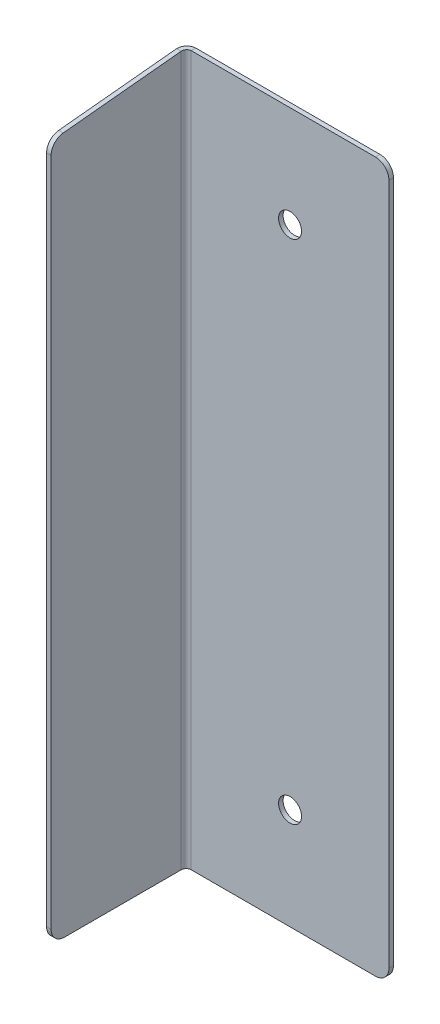
ISO-10303-21;
HEADER;
FILE_DESCRIPTION(('STEP AP214'),'2;1');
FILE_NAME('part.step','',(''),(''),'','','');
FILE_SCHEMA(('AUTOMOTIVE_DESIGN { 1 0 10303 214 1 1 1 1 }'));
ENDSEC;
DATA;
#1=APPLICATION_CONTEXT('core data for automotive mechanical design processes');
#2=APPLICATION_PROTOCOL_DEFINITION('international standard','automotive_design',2000,#1);
#3=PRODUCT_CONTEXT('',#1,'mechanical');
#4=PRODUCT('Part','Part','',(#3));
#5=PRODUCT_RELATED_PRODUCT_CATEGORY('part','',(#4));
#6=PRODUCT_DEFINITION_FORMATION('','',#4);
#7=PRODUCT_DEFINITION_CONTEXT('part definition',#1,'design');
#8=PRODUCT_DEFINITION('design','',#6,#7);
#9=PRODUCT_DEFINITION_SHAPE('','',#8);
#10=(LENGTH_UNIT() NAMED_UNIT(*) SI_UNIT(.MILLI.,.METRE.));
#11=(NAMED_UNIT(*) PLANE_ANGLE_UNIT() SI_UNIT($,.RADIAN.));
#12=(NAMED_UNIT(*) SI_UNIT($,.STERADIAN.) SOLID_ANGLE_UNIT());
#13=UNCERTAINTY_MEASURE_WITH_UNIT(LENGTH_MEASURE(1.E-05),#10,'distance_accuracy_value','');
#14=(GEOMETRIC_REPRESENTATION_CONTEXT(3) GLOBAL_UNCERTAINTY_ASSIGNED_CONTEXT((#13)) GLOBAL_UNIT_ASSIGNED_CONTEXT((#10,
#11,#12)) REPRESENTATION_CONTEXT('',''));
#15=CARTESIAN_POINT('',(0.,0.,0.));
#16=DIRECTION('',(0.,0.,1.));
#17=DIRECTION('',(1.,0.,0.));
#18=AXIS2_PLACEMENT_3D('',#15,#16,#17);
#19=CARTESIAN_POINT('',(-0.67,103.,0.));
#20=DIRECTION('',(0.,0.995037190209989,0.0995037190209991));
#21=DIRECTION('',(0.,-0.0995037190209991,0.995037190209989));
#22=AXIS2_PLACEMENT_3D('',#19,#20,#21);
#23=PLANE('',#22);
#24=DIRECTION('',(0.,-0.099503719020999,0.995037190209989));
#25=VECTOR('',#24,1.);
#26=CARTESIAN_POINT('',(-0.67,103.,0.));
#27=LINE('',#26,#25);
#28=CARTESIAN_POINT('',(-0.670000000000005,104.92634,-19.2634));
#29=VERTEX_POINT('',#28);
#30=CARTESIAN_POINT('',(-0.67,103.180099256196,-1.800992561958));
#31=VERTEX_POINT('',#30);
#32=EDGE_CURVE('E282',#29,#31,#27,.T.);
#33=ORIENTED_EDGE('',*,*,#32,.T.);
#34=DIRECTION('',(1.,0.,0.));
#35=VECTOR('',#34,1.);
#36=CARTESIAN_POINT('',(-0.67,103.180099256196,-1.800992561958));
#37=LINE('',#36,#35);
#38=CARTESIAN_POINT('',(0.,103.180099256196,-1.800992561958));
#39=VERTEX_POINT('',#38);
#40=EDGE_CURVE('E278',#31,#39,#37,.T.);
#41=ORIENTED_EDGE('',*,*,#40,.T.);
#42=DIRECTION('',(0.,-0.099503719020999,0.995037190209989));
#43=VECTOR('',#42,1.);
#44=CARTESIAN_POINT('',(0.,103.,0.));
#45=LINE('',#44,#43);
#46=CARTESIAN_POINT('',(0.,104.92634,-19.2634));
#47=VERTEX_POINT('',#46);
#48=EDGE_CURVE('E492',#47,#39,#45,.T.);
#49=ORIENTED_EDGE('',*,*,#48,.F.);
#50=DIRECTION('',(-1.,0.,0.));
#51=VECTOR('',#50,1.);
#52=CARTESIAN_POINT('',(0.,104.92634,-19.2634));
#53=LINE('',#52,#51);
#54=EDGE_CURVE('E170',#47,#29,#53,.T.);
#55=ORIENTED_EDGE('',*,*,#54,.T.);
#56=EDGE_LOOP('',(#33,#41,#49,#55));
#57=FACE_BOUND('',#56,.T.);
#58=ADVANCED_FACE('F36',(#57),#23,.T.);
#59=CARTESIAN_POINT('',(-0.67,0.,0.));
#60=DIRECTION('',(1.,0.,0.));
#61=DIRECTION('',(0.,0.,-1.));
#62=AXIS2_PLACEMENT_3D('',#59,#60,#61);
#63=PLANE('',#62);
#64=DIRECTION('',(0.,-1.,0.));
#65=VECTOR('',#64,1.);
#66=CARTESIAN_POINT('',(-0.67,103.,0.));
#67=LINE('',#66,#65);
#68=CARTESIAN_POINT('',(-0.67,101.190024875776,0.));
#69=VERTEX_POINT('',#68);
#70=CARTESIAN_POINT('',(-0.67,2.,0.));
#71=VERTEX_POINT('',#70);
#72=EDGE_CURVE('E482',#69,#71,#67,.T.);
#73=ORIENTED_EDGE('',*,*,#72,.F.);
#74=CARTESIAN_POINT('',(-0.67,101.190024875776,-2.));
#75=DIRECTION('',(1.,0.,0.));
#76=DIRECTION('',(0.,0.,-1.));
#77=AXIS2_PLACEMENT_3D('',#74,#75,#76);
#78=CIRCLE('',#77,2.);
#79=EDGE_CURVE('E293',#69,#31,#78,.F.);
#80=ORIENTED_EDGE('',*,*,#79,.T.);
#81=ORIENTED_EDGE('',*,*,#32,.F.);
#82=DIRECTION('',(0.,1.,0.));
#83=VECTOR('',#82,1.);
#84=CARTESIAN_POINT('',(-0.670000000000005,105.,-19.2634));
#85=LINE('',#84,#83);
#86=CARTESIAN_POINT('',(-0.67,0.,-19.2634));
#87=VERTEX_POINT('',#86);
#88=EDGE_CURVE('E136',#29,#87,#85,.F.);
#89=ORIENTED_EDGE('',*,*,#88,.T.);
#90=DIRECTION('',(0.,0.,-1.));
#91=VECTOR('',#90,1.);
#92=CARTESIAN_POINT('',(-0.67,0.,0.));
#93=LINE('',#92,#91);
#94=CARTESIAN_POINT('',(-0.67,0.,-2.));
#95=VERTEX_POINT('',#94);
#96=EDGE_CURVE('E487',#95,#87,#93,.T.);
#97=ORIENTED_EDGE('',*,*,#96,.F.);
#98=CARTESIAN_POINT('',(-0.67,2.,-2.));
#99=DIRECTION('',(1.,0.,0.));
#100=DIRECTION('',(0.,0.,-1.));
#101=AXIS2_PLACEMENT_3D('',#98,#99,#100);
#102=CIRCLE('',#101,2.);
#103=EDGE_CURVE('E291',#95,#71,#102,.F.);
#104=ORIENTED_EDGE('',*,*,#103,.T.);
#105=EDGE_LOOP('',(#73,#80,#81,#89,#97,#104));
#106=FACE_BOUND('',#105,.T.);
#107=ADVANCED_FACE('F201',(#106),#63,.F.);
#108=CARTESIAN_POINT('',(0.,0.,0.));
#109=DIRECTION('',(1.,0.,0.));
#110=DIRECTION('',(0.,0.,-1.));
#111=AXIS2_PLACEMENT_3D('',#108,#109,#110);
#112=PLANE('',#111);
#113=ORIENTED_EDGE('',*,*,#48,.T.);
#114=CARTESIAN_POINT('',(0.,101.190024875776,-2.));
#115=DIRECTION('',(1.,0.,0.));
#116=DIRECTION('',(0.,0.,-1.));
#117=AXIS2_PLACEMENT_3D('',#114,#115,#116);
#118=CIRCLE('',#117,2.);
#119=CARTESIAN_POINT('',(0.,101.190024875776,0.));
#120=VERTEX_POINT('',#119);
#121=EDGE_CURVE('E284',#39,#120,#118,.T.);
#122=ORIENTED_EDGE('',*,*,#121,.T.);
#123=DIRECTION('',(0.,-1.,0.));
#124=VECTOR('',#123,1.);
#125=CARTESIAN_POINT('',(0.,103.,0.));
#126=LINE('',#125,#124);
#127=CARTESIAN_POINT('',(0.,2.,0.));
#128=VERTEX_POINT('',#127);
#129=EDGE_CURVE('E491',#120,#128,#126,.T.);
#130=ORIENTED_EDGE('',*,*,#129,.T.);
#131=CARTESIAN_POINT('',(0.,2.,-2.));
#132=DIRECTION('',(1.,0.,0.));
#133=DIRECTION('',(0.,0.,-1.));
#134=AXIS2_PLACEMENT_3D('',#131,#132,#133);
#135=CIRCLE('',#134,2.);
#136=CARTESIAN_POINT('',(0.,0.,-2.));
#137=VERTEX_POINT('',#136);
#138=EDGE_CURVE('E281',#128,#137,#135,.T.);
#139=ORIENTED_EDGE('',*,*,#138,.T.);
#140=DIRECTION('',(0.,0.,-1.));
#141=VECTOR('',#140,1.);
#142=CARTESIAN_POINT('',(0.,0.,0.));
#143=LINE('',#142,#141);
#144=CARTESIAN_POINT('',(0.,0.,-19.2634));
#145=VERTEX_POINT('',#144);
#146=EDGE_CURVE('E494',#137,#145,#143,.T.);
#147=ORIENTED_EDGE('',*,*,#146,.T.);
#148=DIRECTION('',(0.,1.,0.));
#149=VECTOR('',#148,1.);
#150=CARTESIAN_POINT('',(0.,105.,-19.2634));
#151=LINE('',#150,#149);
#152=EDGE_CURVE('E173',#47,#145,#151,.F.);
#153=ORIENTED_EDGE('',*,*,#152,.F.);
#154=EDGE_LOOP('',(#113,#122,#130,#139,#147,#153));
#155=FACE_BOUND('',#154,.T.);
#156=ADVANCED_FACE('F209',(#155),#112,.T.);
#157=CARTESIAN_POINT('',(-0.67,103.,0.));
#158=DIRECTION('',(0.,0.,1.));
#159=DIRECTION('',(0.,-1.,0.));
#160=AXIS2_PLACEMENT_3D('',#157,#158,#159);
#161=PLANE('',#160);
#162=ORIENTED_EDGE('',*,*,#129,.F.);
#163=DIRECTION('',(1.,0.,0.));
#164=VECTOR('',#163,1.);
#165=CARTESIAN_POINT('',(-0.67,101.190024875776,0.));
#166=LINE('',#165,#164);
#167=EDGE_CURVE('E289',#120,#69,#166,.F.);
#168=ORIENTED_EDGE('',*,*,#167,.T.);
#169=ORIENTED_EDGE('',*,*,#72,.T.);
#170=DIRECTION('',(1.,0.,0.));
#171=VECTOR('',#170,1.);
#172=CARTESIAN_POINT('',(-0.67,2.,0.));
#173=LINE('',#172,#171);
#174=EDGE_CURVE('E286',#71,#128,#173,.T.);
#175=ORIENTED_EDGE('',*,*,#174,.T.);
#176=EDGE_LOOP('',(#162,#168,#169,#175));
#177=FACE_BOUND('',#176,.T.);
#178=ADVANCED_FACE('F213',(#177),#161,.T.);
#179=CARTESIAN_POINT('',(-0.67,0.,0.));
#180=DIRECTION('',(0.,-1.,0.));
#181=DIRECTION('',(0.,0.,-1.));
#182=AXIS2_PLACEMENT_3D('',#179,#180,#181);
#183=PLANE('',#182);
#184=ORIENTED_EDGE('',*,*,#146,.F.);
#185=DIRECTION('',(1.,0.,0.));
#186=VECTOR('',#185,1.);
#187=CARTESIAN_POINT('',(-0.67,0.,-2.));
#188=LINE('',#187,#186);
#189=EDGE_CURVE('E11',#137,#95,#188,.F.);
#190=ORIENTED_EDGE('',*,*,#189,.T.);
#191=ORIENTED_EDGE('',*,*,#96,.T.);
#192=DIRECTION('',(-1.,0.,0.));
#193=VECTOR('',#192,1.);
#194=CARTESIAN_POINT('',(0.,0.,-19.2634));
#195=LINE('',#194,#193);
#196=EDGE_CURVE('E495',#145,#87,#195,.T.);
#197=ORIENTED_EDGE('',*,*,#196,.F.);
#198=EDGE_LOOP('',(#184,#190,#191,#197));
#199=FACE_BOUND('',#198,.T.);
#200=ADVANCED_FACE('F195',(#199),#183,.T.);
#201=CARTESIAN_POINT('',(0.736599999999999,0.,-19.2634));
#202=DIRECTION('',(0.,-1.,0.));
#203=DIRECTION('',(0.,0.,-1.));
#204=AXIS2_PLACEMENT_3D('',#201,#202,#203);
#205=PLANE('',#204);
#206=DIRECTION('',(0.,0.,-1.));
#207=VECTOR('',#206,1.);
#208=CARTESIAN_POINT('',(0.736599999999997,0.,-20.));
#209=LINE('',#208,#207);
#210=CARTESIAN_POINT('',(0.736599999999996,0.,-20.));
#211=VERTEX_POINT('',#210);
#212=CARTESIAN_POINT('',(0.736599999999994,0.,-20.67));
#213=VERTEX_POINT('',#212);
#214=EDGE_CURVE('E258',#211,#213,#209,.T.);
#215=ORIENTED_EDGE('',*,*,#214,.F.);
#216=CARTESIAN_POINT('',(0.736599999999999,0.,-19.2634));
#217=DIRECTION('',(0.,1.,0.));
#218=DIRECTION('',(0.,0.,1.));
#219=AXIS2_PLACEMENT_3D('',#216,#217,#218);
#220=CIRCLE('',#219,0.736600000000004);
#221=EDGE_CURVE('E139',#145,#211,#220,.F.);
#222=ORIENTED_EDGE('',*,*,#221,.F.);
#223=ORIENTED_EDGE('',*,*,#196,.T.);
#224=CARTESIAN_POINT('',(0.736599999999999,0.,-19.2634));
#225=DIRECTION('',(0.,1.,0.));
#226=DIRECTION('',(0.,0.,1.));
#227=AXIS2_PLACEMENT_3D('',#224,#225,#226);
#228=CIRCLE('',#227,1.4066);
#229=EDGE_CURVE('E168',#87,#213,#228,.F.);
#230=ORIENTED_EDGE('',*,*,#229,.T.);
#231=EDGE_LOOP('',(#215,#222,#223,#230));
#232=FACE_BOUND('',#231,.T.);
#233=ADVANCED_FACE('F192',(#232),#205,.T.);
#234=CARTESIAN_POINT('',(0.736600000000003,105.,-20.6767));
#235=CARTESIAN_POINT('',(0.551566144040595,104.993860561138,-20.6767));
#236=CARTESIAN_POINT('',(0.366671715035029,104.987723333333,-20.6399155839353));
#237=CARTESIAN_POINT('',(0.0248352950418043,104.975446666667,-20.4983223026611));
#238=CARTESIAN_POINT('',(-0.131938879340552,104.969308333333,-20.3935691483613));
#239=CARTESIAN_POINT('',(-0.393569148361354,104.957031666667,-20.1319388793405));
#240=CARTESIAN_POINT('',(-0.49832230266108,104.950893333333,-19.9751647049582));
#241=CARTESIAN_POINT('',(-0.639915583935337,104.938616666667,-19.633328284965));
#242=CARTESIAN_POINT('',(-0.676700000000006,104.932479438862,-19.4484338559594));
#243=CARTESIAN_POINT('',(-0.676700000000005,104.92634,-19.2634));
#244=CARTESIAN_POINT('',(0.736600000000003,105.,-20.67));
#245=CARTESIAN_POINT('',(0.552443330448641,104.993860561171,-20.67));
#246=CARTESIAN_POINT('',(0.368425425860236,104.987723333333,-20.6333899670017));
#247=CARTESIAN_POINT('',(0.0282095422102893,104.975446666667,-20.4924679338591));
#248=CARTESIAN_POINT('',(-0.12782141631672,104.969308333333,-20.3882113805173));
#249=CARTESIAN_POINT('',(-0.388211380517286,104.957031666667,-20.1278214163167));
#250=CARTESIAN_POINT('',(-0.492467933859106,104.950893333333,-19.9717904577897));
#251=CARTESIAN_POINT('',(-0.63338996700166,104.938616666667,-19.6315745741398));
#252=CARTESIAN_POINT('',(-0.670000000000006,104.932479438829,-19.4475566695514));
#253=CARTESIAN_POINT('',(-0.670000000000005,104.92634,-19.2634));
#254=CARTESIAN_POINT('',(0.736600000000001,105.,-20.));
#255=CARTESIAN_POINT('',(0.640161971253188,104.993860564409,-20.));
#256=CARTESIAN_POINT('',(0.543796508380953,104.987723333333,-19.9808282736339));
#257=CARTESIAN_POINT('',(0.365634259058792,104.975446666667,-19.9070310536617));
#258=CARTESIAN_POINT('',(0.283924886066474,104.969308333333,-19.8524345961105));
#259=CARTESIAN_POINT('',(0.147565403889495,104.957031666667,-19.7160751139335));
#260=CARTESIAN_POINT('',(0.092968946338248,104.950893333333,-19.6343657409412));
#261=CARTESIAN_POINT('',(0.0191717263661129,104.938616666667,-19.456203491619));
#262=CARTESIAN_POINT('',(0.,104.932479435591,-19.3598380287468));
#263=CARTESIAN_POINT('',(0.,104.92634,-19.2634));
#264=CARTESIAN_POINT('',(0.736600000000001,105.,-19.993233));
#265=CARTESIAN_POINT('',(0.641047929525314,104.993860564442,-19.993233));
#266=CARTESIAN_POINT('',(0.545567756314412,104.987723333333,-19.9742374005309));
#267=CARTESIAN_POINT('',(0.369042248698962,104.975446666667,-19.9011181411718));
#268=CARTESIAN_POINT('',(0.288083523720544,104.969308333333,-19.847023250588));
#269=CARTESIAN_POINT('',(0.152976749412004,104.957031666667,-19.7119164762795));
#270=CARTESIAN_POINT('',(0.0988818588282413,104.950893333333,-19.630957751301));
#271=CARTESIAN_POINT('',(0.0257625994691274,104.938616666667,-19.4544322436856));
#272=CARTESIAN_POINT('',(0.00676699999999434,104.932479435558,-19.3589520704747));
#273=CARTESIAN_POINT('',(0.0067669999999948,104.92634,-19.2634));
#274=B_SPLINE_SURFACE_WITH_KNOTS('',1,3,((#234,#235,#236,#237,#238,#239,#240,#241,#242,#243),
(#244,#245,#246,#247,#248,#249,#250,#251,#252,#253),(#254,#255,#256,#257,#258,#259,#260,#261,
#262,#263),(#264,#265,#266,#267,#268,#269,#270,#271,#272,#273)),.UNSPECIFIED.,.F.,.F.,.F.,(2,1,
1,2),(4,2,2,2,4),(-0.01,0.,1.,1.0101),(0.,0.25,0.5,0.75,1.),.UNSPECIFIED.);
#275=CARTESIAN_POINT('',(0.736600000000001,105.,-20.));
#276=CARTESIAN_POINT('',(0.724547398513029,104.999232708333,-20.0000002556656));
#277=CARTESIAN_POINT('',(0.712494818780693,104.998465416667,-19.9997041940544));
#278=CARTESIAN_POINT('',(0.688418683400155,104.996930833333,-19.9985212720271));
#279=CARTESIAN_POINT('',(0.676395127751952,104.996163541667,-19.997634411611));
#280=CARTESIAN_POINT('',(0.652406021114539,104.994628958333,-19.9952717277225));
#281=CARTESIAN_POINT('',(0.640440470125329,104.993861666667,-19.9937959042502));
#282=CARTESIAN_POINT('',(0.616596194907031,104.992327083333,-19.9902589302299));
#283=CARTESIAN_POINT('',(0.604717470677944,104.991559791667,-19.988197779682));
#284=CARTESIAN_POINT('',(0.581075466927894,104.990025208333,-19.983495095408));
#285=CARTESIAN_POINT('',(0.569312187406932,104.989257916667,-19.980853561682));
#286=CARTESIAN_POINT('',(0.545929411559577,104.987723333333,-19.9749964805242));
#287=CARTESIAN_POINT('',(0.534309915233186,104.986956041667,-19.9717809330925));
#288=CARTESIAN_POINT('',(0.511242698235538,104.985421458333,-19.9647835695082));
#289=CARTESIAN_POINT('',(0.499794977564281,104.984654166667,-19.9610017533558));
#290=CARTESIAN_POINT('',(0.477098890418296,104.983119583333,-19.9528809634719));
#291=CARTESIAN_POINT('',(0.465850523943566,104.982352291667,-19.9485419897405));
#292=CARTESIAN_POINT('',(0.443580243496179,104.980817708333,-19.9393173375552));
#293=CARTESIAN_POINT('',(0.432558329523522,104.980050416667,-19.9344316591013));
#294=CARTESIAN_POINT('',(0.410767506834981,104.978515833333,-19.9241253675282));
#295=CARTESIAN_POINT('',(0.399998598119097,104.977748541667,-19.918704754409));
#296=CARTESIAN_POINT('',(0.378739729188837,104.976213958333,-19.907341652229));
#297=CARTESIAN_POINT('',(0.36824976897446,104.975446666667,-19.9013991631683));
#298=CARTESIAN_POINT('',(0.347574068280079,104.973912083333,-19.8890066250841));
#299=CARTESIAN_POINT('',(0.337388327800073,104.973144791667,-19.8825565760606));
#300=CARTESIAN_POINT('',(0.317345604915443,104.971610208333,-19.8691644567835));
#301=CARTESIAN_POINT('',(0.307488622510817,104.970842916667,-19.8622223865298));
#302=CARTESIAN_POINT('',(0.288127162110922,104.969308333333,-19.8478629488475));
#303=CARTESIAN_POINT('',(0.278622684115653,104.968541041667,-19.840445581419));
#304=CARTESIAN_POINT('',(0.259989129654456,104.967006458333,-19.825153418475));
#305=CARTESIAN_POINT('',(0.250860053188529,104.966239166667,-19.8172786229594));
#306=CARTESIAN_POINT('',(0.232999294530835,104.964704583333,-19.8010905749135));
#307=CARTESIAN_POINT('',(0.224267612339068,104.963937291667,-19.7927773223831));
#308=CARTESIAN_POINT('',(0.207222677616901,104.962402708333,-19.7757323876609));
#309=CARTESIAN_POINT('',(0.198909425086501,104.961635416667,-19.7670007054692));
#310=CARTESIAN_POINT('',(0.182721377040564,104.960100833333,-19.7491399468115));
#311=CARTESIAN_POINT('',(0.174846581525028,104.959333541667,-19.7400108703455));
#312=CARTESIAN_POINT('',(0.159554418580978,104.957798958333,-19.7213773158843));
#313=CARTESIAN_POINT('',(0.152137051152464,104.957031666667,-19.7118728378891));
#314=CARTESIAN_POINT('',(0.137777613470239,104.955497083333,-19.6925113774892));
#315=CARTESIAN_POINT('',(0.130835543216527,104.954729791667,-19.6826543950846));
#316=CARTESIAN_POINT('',(0.117443423939353,104.953195208333,-19.6626116721999));
#317=CARTESIAN_POINT('',(0.110993374915891,104.952427916667,-19.6524259317199));
#318=CARTESIAN_POINT('',(0.0986008368316979,104.950893333333,-19.6317502310255));
#319=CARTESIAN_POINT('',(0.0926583477709667,104.950126041667,-19.6212602708112));
#320=CARTESIAN_POINT('',(0.0812952455910252,104.948591458333,-19.6000014018809));
#321=CARTESIAN_POINT('',(0.0758746324718151,104.947824166667,-19.589232493165));
#322=CARTESIAN_POINT('',(0.065568340898717,104.946289583333,-19.5674416704765));
#323=CARTESIAN_POINT('',(0.060682662444829,104.945522291667,-19.5564197565038));
#324=CARTESIAN_POINT('',(0.0514580102595323,104.943987708333,-19.5341494760564));
#325=CARTESIAN_POINT('',(0.0471190365281236,104.943220416667,-19.5229011095817));
#326=CARTESIAN_POINT('',(0.0389982466442383,104.941685833333,-19.5002050224357));
#327=CARTESIAN_POINT('',(0.0352164304917619,104.940918541667,-19.4887573017645));
#328=CARTESIAN_POINT('',(0.0282190669075367,104.939383958333,-19.4656900847668));
#329=CARTESIAN_POINT('',(0.0250035194757879,104.938616666667,-19.4540705884404));
#330=CARTESIAN_POINT('',(0.0191464383179986,104.937082083333,-19.4306878125931));
#331=CARTESIAN_POINT('',(0.0165049045919581,104.936314791667,-19.4189245330721));
#332=CARTESIAN_POINT('',(0.0118022203179917,104.934780208333,-19.3952825293221));
#333=CARTESIAN_POINT('',(0.00974106977006567,104.934012916667,-19.383403805093));
#334=CARTESIAN_POINT('',(0.00620409574980769,104.932478333333,-19.3595595298747));
#335=CARTESIAN_POINT('',(0.00472827227747573,104.931711041667,-19.3475939788855));
#336=CARTESIAN_POINT('',(0.002365588389033,104.930176458333,-19.323604872248));
#337=CARTESIAN_POINT('',(0.00147872797292219,104.929409166667,-19.3115813165998));
#338=CARTESIAN_POINT('',(0.000295805945607165,104.927874583333,-19.2875051812193));
#339=CARTESIAN_POINT('',(-2.55665597054882E-07,104.927107291667,-19.275452601487));
#340=CARTESIAN_POINT('',(0.,104.92634,-19.2634));
#341=B_SPLINE_CURVE_WITH_KNOTS('',3,(#275,#276,#277,#278,#279,#280,#281,#282,#283,#284,#285,
#286,#287,#288,#289,#290,#291,#292,#293,#294,#295,#296,#297,#298,#299,#300,#301,#302,#303,#304,
#305,#306,#307,#308,#309,#310,#311,#312,#313,#314,#315,#316,#317,#318,#319,#320,#321,#322,#323,
#324,#325,#326,#327,#328,#329,#330,#331,#332,#333,#334,#335,#336,#337,#338,#339,#340),
.UNSPECIFIED.,.F.,.F.,(4,2,2,2,2,2,2,2,2,2,2,2,2,2,2,2,2,2,2,2,2,2,2,2,2,2,2,2,2,2,2,2,4),(0.,
0.0362273420624842,0.0724546841249683,0.108682026187453,0.144909368249937,0.181136710312421,
0.217364052374905,0.253591394437389,0.289818736499874,0.326046078562357,0.362273420624842,
0.398500762687326,0.434728104749811,0.470955446812294,0.507182788874778,0.543410130937262,
0.579637472999748,0.615864815062232,0.652092157124716,0.688319499187199,0.724546841249684,
0.76077418331217,0.797001525374652,0.833228867437137,0.869456209499622,0.905683551562104,
0.941910893624591,0.978138235687075,1.01436557774956,1.05059291981204,1.08682026187453,
1.12304760393701,1.15927494599949),.UNSPECIFIED.);
#342=CARTESIAN_POINT('',(0.736599999999996,105.,-20.));
#343=VERTEX_POINT('',#342);
#344=EDGE_CURVE('E146',#343,#47,#341,.T.);
#345=DIRECTION('',(0.,0.,-1.));
#346=VECTOR('',#345,1.);
#347=CARTESIAN_POINT('',(0.7366,105.,-20.));
#348=LINE('',#347,#346);
#349=CARTESIAN_POINT('',(0.7366,105.,-20.67));
#350=VERTEX_POINT('',#349);
#351=EDGE_CURVE('E143',#343,#350,#348,.T.);
#352=CARTESIAN_POINT('',(0.736600000000003,105.,-20.67));
#353=CARTESIAN_POINT('',(0.713584538078234,104.999232708333,-20.6700004882151));
#354=CARTESIAN_POINT('',(0.690569117698784,104.998465416667,-20.6694351335282));
#355=CARTESIAN_POINT('',(0.644593700883328,104.996930833333,-20.6671762438682));
#356=CARTESIAN_POINT('',(0.621633704447321,104.996163541667,-20.6654827088949));
#357=CARTESIAN_POINT('',(0.575824476377562,104.994628958333,-20.6609709641793));
#358=CARTESIAN_POINT('',(0.552975244743808,104.993861666667,-20.658152754437));
#359=CARTESIAN_POINT('',(0.50744258451837,104.992327083333,-20.6513986033959));
#360=CARTESIAN_POINT('',(0.484759155926687,104.991559791667,-20.6474626620971));
#361=CARTESIAN_POINT('',(0.439612750177542,104.990025208333,-20.6384824887333));
#362=CARTESIAN_POINT('',(0.417149773020081,104.989257916667,-20.6334382566683));
#363=CARTESIAN_POINT('',(0.372498384876057,104.987723333333,-20.6222536648186));
#364=CARTESIAN_POINT('',(0.350309973889493,104.986956041667,-20.6161133050337));
#365=CARTESIAN_POINT('',(0.306261172058253,104.985421458333,-20.6027512474481));
#366=CARTESIAN_POINT('',(0.284400781213577,104.984654166667,-20.5955295496473));
#367=CARTESIAN_POINT('',(0.241060683223428,104.983119583333,-20.5800222145256));
#368=CARTESIAN_POINT('',(0.219580976077955,104.982352291667,-20.5717365772046));
#369=CARTESIAN_POINT('',(0.177053991992571,104.980817708333,-20.5541213236561));
#370=CARTESIAN_POINT('',(0.156006715052659,104.980050416667,-20.5447917074285));
#371=CARTESIAN_POINT('',(0.114395296109268,104.978515833333,-20.5251109719863));
#372=CARTESIAN_POINT('',(0.0938311541057893,104.977748541667,-20.5147598527717));
#373=CARTESIAN_POINT('',(0.0532355458553085,104.976213958333,-20.4930610480931));
#374=CARTESIAN_POINT('',(0.0332040796083064,104.975446666667,-20.481713362629));
#375=CARTESIAN_POINT('',(-0.00627791957268408,104.973912083333,-20.4580487630238));
#376=CARTESIAN_POINT('',(-0.0257284525066725,104.973144791667,-20.4457318488826));
#377=CARTESIAN_POINT('',(-0.064001727024079,104.971610208333,-20.420158464447));
#378=CARTESIAN_POINT('',(-0.0828244686074972,104.970842916667,-20.4069019941525));
#379=CARTESIAN_POINT('',(-0.119796814790625,104.969308333333,-20.3794814334088));
#380=CARTESIAN_POINT('',(-0.137946419390334,104.968541041667,-20.3653173429595));
#381=CARTESIAN_POINT('',(-0.173528767618842,104.967006458333,-20.3361156644405));
#382=CARTESIAN_POINT('',(-0.190961511247641,104.966239166667,-20.3210780763708));
#383=CARTESIAN_POINT('',(-0.225068140528,104.964704583333,-20.2901656294778));
#384=CARTESIAN_POINT('',(-0.241742026179561,104.963937291667,-20.2742907706544));
#385=CARTESIAN_POINT('',(-0.274290770654446,104.962402708333,-20.2417420261796));
#386=CARTESIAN_POINT('',(-0.29016562947777,104.961635416667,-20.225068140528));
#387=CARTESIAN_POINT('',(-0.321078076370811,104.960100833333,-20.1909615112476));
#388=CARTESIAN_POINT('',(-0.336115664440529,104.959333541667,-20.1735287676188));
#389=CARTESIAN_POINT('',(-0.365317342959535,104.957798958333,-20.1379464193903));
#390=CARTESIAN_POINT('',(-0.379481433408825,104.957031666667,-20.1197968147906));
#391=CARTESIAN_POINT('',(-0.406901994152537,104.955497083333,-20.0828244686075));
#392=CARTESIAN_POINT('',(-0.420158464446959,104.954729791667,-20.0640017270241));
#393=CARTESIAN_POINT('',(-0.445731848882573,104.953195208333,-20.0257284525067));
#394=CARTESIAN_POINT('',(-0.458048763023765,104.952427916667,-20.0062779195727));
#395=CARTESIAN_POINT('',(-0.481713362629013,104.950893333333,-19.9667959203917));
#396=CARTESIAN_POINT('',(-0.49306104809307,104.950126041667,-19.9467644541447));
#397=CARTESIAN_POINT('',(-0.514759852771735,104.948591458333,-19.9061688458942));
#398=CARTESIAN_POINT('',(-0.525110971986344,104.947824166667,-19.8856047038907));
#399=CARTESIAN_POINT('',(-0.544791707428539,104.946289583333,-19.8439932849473));
#400=CARTESIAN_POINT('',(-0.554121323656124,104.945522291667,-19.8229460080074));
#401=CARTESIAN_POINT('',(-0.571736577204641,104.943987708333,-19.780419023922));
#402=CARTESIAN_POINT('',(-0.580022214525574,104.943220416667,-19.7589393167766));
#403=CARTESIAN_POINT('',(-0.595529549647313,104.941685833333,-19.7155992187864));
#404=CARTESIAN_POINT('',(-0.602751247448119,104.940918541667,-19.6937388279417));
#405=CARTESIAN_POINT('',(-0.616113305033744,104.939383958333,-19.6496900261105));
#406=CARTESIAN_POINT('',(-0.622253664818563,104.938616666667,-19.6275016151239));
#407=CARTESIAN_POINT('',(-0.633438256668341,104.937082083333,-19.5828502269799));
#408=CARTESIAN_POINT('',(-0.638482488733299,104.936314791667,-19.5603872498225));
#409=CARTESIAN_POINT('',(-0.64746266209708,104.934780208333,-19.5152408440733));
#410=CARTESIAN_POINT('',(-0.651398603395903,104.934012916667,-19.4925574154816));
#411=CARTESIAN_POINT('',(-0.658152754437031,104.932478333333,-19.4470247552562));
#412=CARTESIAN_POINT('',(-0.660970964179336,104.931711041667,-19.4241755236224));
#413=CARTESIAN_POINT('',(-0.665482708894899,104.930176458333,-19.3783662955527));
#414=CARTESIAN_POINT('',(-0.667176243868157,104.929409166667,-19.3554062991167));
#415=CARTESIAN_POINT('',(-0.669435133528245,104.927874583333,-19.3094308823012));
#416=CARTESIAN_POINT('',(-0.670000488215077,104.927107291667,-19.2864154619218));
#417=CARTESIAN_POINT('',(-0.670000000000005,104.92634,-19.2634));
#418=B_SPLINE_CURVE_WITH_KNOTS('',3,(#352,#353,#354,#355,#356,#357,#358,#359,#360,#361,#362,
#363,#364,#365,#366,#367,#368,#369,#370,#371,#372,#373,#374,#375,#376,#377,#378,#379,#380,#381,
#382,#383,#384,#385,#386,#387,#388,#389,#390,#391,#392,#393,#394,#395,#396,#397,#398,#399,#400,
#401,#402,#403,#404,#405,#406,#407,#408,#409,#410,#411,#412,#413,#414,#415,#416,#417),
.UNSPECIFIED.,.F.,.F.,(4,2,2,2,2,2,2,2,2,2,2,2,2,2,2,2,2,2,2,2,2,2,2,2,2,2,2,2,2,2,2,2,4),(0.,
0.0690777473775177,0.138155494755035,0.207233242132553,0.276310989510071,0.345388736887589,
0.414466484265106,0.483544231642624,0.552621979020141,0.621699726397659,0.690777473775177,
0.759855221152695,0.828932968530212,0.898010715907729,0.967088463285248,1.03616621066277,
1.10524395804028,1.1743217054178,1.24339945279532,1.31247720017284,1.38155494755036,
1.45063269492787,1.51971044230539,1.58878818968291,1.65786593706042,1.72694368443794,
1.79602143181546,1.86509917919298,1.9341769265705,2.00325467394801,2.07233242132553,
2.14141016870305,2.21048791608057),.UNSPECIFIED.);
#419=EDGE_CURVE('E128',#350,#29,#418,.T.);
#420=ORIENTED_EDGE('',*,*,#344,.F.);
#421=ORIENTED_EDGE('',*,*,#351,.T.);
#422=ORIENTED_EDGE('',*,*,#419,.T.);
#423=ORIENTED_EDGE('',*,*,#54,.F.);
#424=EDGE_LOOP('',(#420,#421,#422,#423));
#425=FACE_BOUND('',#424,.T.);
#426=ADVANCED_FACE('F144',(#425),#274,.F.);
#427=CARTESIAN_POINT('',(0.736599999999999,105.,-19.2634));
#428=DIRECTION('',(0.,1.,0.));
#429=DIRECTION('',(0.,0.,-1.));
#430=AXIS2_PLACEMENT_3D('',#427,#428,#429);
#431=CYLINDRICAL_SURFACE('',#430,1.4066);
#432=ORIENTED_EDGE('',*,*,#88,.F.);
#433=ORIENTED_EDGE('',*,*,#419,.F.);
#434=DIRECTION('',(0.,-1.,0.));
#435=VECTOR('',#434,1.);
#436=CARTESIAN_POINT('',(0.736599999999997,0.,-20.67));
#437=LINE('',#436,#435);
#438=EDGE_CURVE('E133',#350,#213,#437,.T.);
#439=ORIENTED_EDGE('',*,*,#438,.T.);
#440=ORIENTED_EDGE('',*,*,#229,.F.);
#441=EDGE_LOOP('',(#432,#433,#439,#440));
#442=FACE_BOUND('',#441,.T.);
#443=ADVANCED_FACE('F130',(#442),#431,.T.);
#444=CARTESIAN_POINT('',(0.736599999999999,105.,-19.2634));
#445=DIRECTION('',(0.,1.,0.));
#446=DIRECTION('',(0.,0.,-1.));
#447=AXIS2_PLACEMENT_3D('',#444,#445,#446);
#448=CYLINDRICAL_SURFACE('',#447,0.736600000000004);
#449=ORIENTED_EDGE('',*,*,#152,.T.);
#450=ORIENTED_EDGE('',*,*,#221,.T.);
#451=DIRECTION('',(0.,1.,0.));
#452=VECTOR('',#451,1.);
#453=CARTESIAN_POINT('',(0.736599999999997,0.,-20.));
#454=LINE('',#453,#452);
#455=EDGE_CURVE('E148',#211,#343,#454,.T.);
#456=ORIENTED_EDGE('',*,*,#455,.T.);
#457=ORIENTED_EDGE('',*,*,#344,.T.);
#458=EDGE_LOOP('',(#449,#450,#456,#457));
#459=FACE_BOUND('',#458,.T.);
#460=ADVANCED_FACE('F179',(#459),#448,.F.);
#461=CARTESIAN_POINT('',(0.,0.,-20.67));
#462=DIRECTION('',(0.,1.,0.));
#463=DIRECTION('',(0.,0.,1.));
#464=AXIS2_PLACEMENT_3D('',#461,#462,#463);
#465=PLANE('',#464);
#466=DIRECTION('',(-1.,0.,0.));
#467=VECTOR('',#466,1.);
#468=CARTESIAN_POINT('',(0.,0.,-20.67));
#469=LINE('',#468,#467);
#470=CARTESIAN_POINT('',(28.,0.,-20.6700000000001));
#471=VERTEX_POINT('',#470);
#472=EDGE_CURVE('E153',#471,#213,#469,.T.);
#473=ORIENTED_EDGE('',*,*,#472,.F.);
#474=DIRECTION('',(0.,0.,1.));
#475=VECTOR('',#474,1.);
#476=CARTESIAN_POINT('',(28.,0.,-20.6700000000001));
#477=LINE('',#476,#475);
#478=CARTESIAN_POINT('',(28.,0.,-20.0000000000001));
#479=VERTEX_POINT('',#478);
#480=EDGE_CURVE('E44',#471,#479,#477,.T.);
#481=ORIENTED_EDGE('',*,*,#480,.T.);
#482=DIRECTION('',(-1.,0.,0.));
#483=VECTOR('',#482,1.);
#484=CARTESIAN_POINT('',(0.,0.,-20.));
#485=LINE('',#484,#483);
#486=EDGE_CURVE('E154',#479,#211,#485,.T.);
#487=ORIENTED_EDGE('',*,*,#486,.T.);
#488=ORIENTED_EDGE('',*,*,#214,.T.);
#489=EDGE_LOOP('',(#473,#481,#487,#488));
#490=FACE_BOUND('',#489,.T.);
#491=ADVANCED_FACE('F188',(#490),#465,.F.);
#492=CARTESIAN_POINT('',(30.,105.,-20.6700000000001));
#493=DIRECTION('',(0.,-1.,0.));
#494=DIRECTION('',(0.,0.,-1.));
#495=AXIS2_PLACEMENT_3D('',#492,#493,#494);
#496=PLANE('',#495);
#497=DIRECTION('',(1.,0.,0.));
#498=VECTOR('',#497,1.);
#499=CARTESIAN_POINT('',(30.,105.,-20.0000000000001));
#500=LINE('',#499,#498);
#501=CARTESIAN_POINT('',(28.,105.,-20.0000000000001));
#502=VERTEX_POINT('',#501);
#503=EDGE_CURVE('E164',#343,#502,#500,.T.);
#504=ORIENTED_EDGE('',*,*,#503,.T.);
#505=DIRECTION('',(0.,0.,1.));
#506=VECTOR('',#505,1.);
#507=CARTESIAN_POINT('',(28.,105.,-20.6700000000001));
#508=LINE('',#507,#506);
#509=CARTESIAN_POINT('',(28.,105.,-20.6700000000001));
#510=VERTEX_POINT('',#509);
#511=EDGE_CURVE('E59',#502,#510,#508,.F.);
#512=ORIENTED_EDGE('',*,*,#511,.T.);
#513=DIRECTION('',(1.,0.,0.));
#514=VECTOR('',#513,1.);
#515=CARTESIAN_POINT('',(30.,105.,-20.6700000000001));
#516=LINE('',#515,#514);
#517=EDGE_CURVE('E151',#350,#510,#516,.T.);
#518=ORIENTED_EDGE('',*,*,#517,.F.);
#519=ORIENTED_EDGE('',*,*,#351,.F.);
#520=EDGE_LOOP('',(#504,#512,#518,#519));
#521=FACE_BOUND('',#520,.T.);
#522=ADVANCED_FACE('F156',(#521),#496,.F.);
#523=CARTESIAN_POINT('',(0.,0.,-20.67));
#524=DIRECTION('',(0.,0.,1.));
#525=DIRECTION('',(1.,0.,0.));
#526=AXIS2_PLACEMENT_3D('',#523,#524,#525);
#527=PLANE('',#526);
#528=CARTESIAN_POINT('',(15.3683,15.,-20.6700000000001));
#529=DIRECTION('',(0.,0.,-1.));
#530=DIRECTION('',(-1.,0.,0.));
#531=AXIS2_PLACEMENT_3D('',#528,#529,#530);
#532=CIRCLE('',#531,1.7);
#533=CARTESIAN_POINT('',(13.6683,15.,-20.67));
#534=VERTEX_POINT('',#533);
#535=EDGE_CURVE('E267',#534,#534,#532,.T.);
#536=ORIENTED_EDGE('',*,*,#535,.F.);
#537=EDGE_LOOP('',(#536));
#538=FACE_BOUND('',#537,.T.);
#539=CARTESIAN_POINT('',(15.3683,90.,-20.67));
#540=DIRECTION('',(0.,0.,-1.));
#541=DIRECTION('',(-1.,0.,0.));
#542=AXIS2_PLACEMENT_3D('',#539,#540,#541);
#543=CIRCLE('',#542,1.7);
#544=CARTESIAN_POINT('',(13.6683,90.,-20.67));
#545=VERTEX_POINT('',#544);
#546=EDGE_CURVE('E263',#545,#545,#543,.T.);
#547=ORIENTED_EDGE('',*,*,#546,.F.);
#548=EDGE_LOOP('',(#547));
#549=FACE_BOUND('',#548,.T.);
#550=ORIENTED_EDGE('',*,*,#517,.T.);
#551=CARTESIAN_POINT('',(28.,103.,-20.6700000000001));
#552=DIRECTION('',(0.,0.,1.));
#553=DIRECTION('',(1.,0.,0.));
#554=AXIS2_PLACEMENT_3D('',#551,#552,#553);
#555=CIRCLE('',#554,2.);
#556=CARTESIAN_POINT('',(30.,103.,-20.6700000000001));
#557=VERTEX_POINT('',#556);
#558=EDGE_CURVE('E243',#510,#557,#555,.F.);
#559=ORIENTED_EDGE('',*,*,#558,.T.);
#560=DIRECTION('',(0.,-1.,0.));
#561=VECTOR('',#560,1.);
#562=CARTESIAN_POINT('',(30.,0.,-20.6700000000001));
#563=LINE('',#562,#561);
#564=CARTESIAN_POINT('',(30.,2.,-20.6700000000001));
#565=VERTEX_POINT('',#564);
#566=EDGE_CURVE('E157',#557,#565,#563,.T.);
#567=ORIENTED_EDGE('',*,*,#566,.T.);
#568=CARTESIAN_POINT('',(28.,2.,-20.6700000000001));
#569=DIRECTION('',(0.,0.,1.));
#570=DIRECTION('',(1.,0.,0.));
#571=AXIS2_PLACEMENT_3D('',#568,#569,#570);
#572=CIRCLE('',#571,2.);
#573=EDGE_CURVE('E51',#565,#471,#572,.F.);
#574=ORIENTED_EDGE('',*,*,#573,.T.);
#575=ORIENTED_EDGE('',*,*,#472,.T.);
#576=ORIENTED_EDGE('',*,*,#438,.F.);
#577=EDGE_LOOP('',(#550,#559,#567,#574,#575,#576));
#578=FACE_BOUND('',#577,.T.);
#579=ADVANCED_FACE('F150',(#538,#549,#578),#527,.F.);
#580=CARTESIAN_POINT('',(0.,0.,-20.));
#581=DIRECTION('',(0.,0.,1.));
#582=DIRECTION('',(1.,0.,0.));
#583=AXIS2_PLACEMENT_3D('',#580,#581,#582);
#584=PLANE('',#583);
#585=CARTESIAN_POINT('',(15.3683,15.,-20.0000000000001));
#586=DIRECTION('',(0.,0.,1.));
#587=DIRECTION('',(1.,0.,0.));
#588=AXIS2_PLACEMENT_3D('',#585,#586,#587);
#589=CIRCLE('',#588,1.7);
#590=CARTESIAN_POINT('',(17.0683,15.,-20.0000000000001));
#591=VERTEX_POINT('',#590);
#592=EDGE_CURVE('E266',#591,#591,#589,.T.);
#593=ORIENTED_EDGE('',*,*,#592,.F.);
#594=EDGE_LOOP('',(#593));
#595=FACE_BOUND('',#594,.T.);
#596=CARTESIAN_POINT('',(15.3683,90.,-20.));
#597=DIRECTION('',(0.,0.,1.));
#598=DIRECTION('',(1.,0.,0.));
#599=AXIS2_PLACEMENT_3D('',#596,#597,#598);
#600=CIRCLE('',#599,1.7);
#601=CARTESIAN_POINT('',(17.0683,90.,-20.0000000000001));
#602=VERTEX_POINT('',#601);
#603=EDGE_CURVE('E260',#602,#602,#600,.T.);
#604=ORIENTED_EDGE('',*,*,#603,.F.);
#605=EDGE_LOOP('',(#604));
#606=FACE_BOUND('',#605,.T.);
#607=DIRECTION('',(0.,-1.,0.));
#608=VECTOR('',#607,1.);
#609=CARTESIAN_POINT('',(30.,0.,-20.0000000000001));
#610=LINE('',#609,#608);
#611=CARTESIAN_POINT('',(30.,103.,-20.0000000000001));
#612=VERTEX_POINT('',#611);
#613=CARTESIAN_POINT('',(30.,2.,-20.0000000000001));
#614=VERTEX_POINT('',#613);
#615=EDGE_CURVE('E160',#612,#614,#610,.T.);
#616=ORIENTED_EDGE('',*,*,#615,.F.);
#617=CARTESIAN_POINT('',(28.,103.,-20.0000000000001));
#618=DIRECTION('',(0.,0.,1.));
#619=DIRECTION('',(1.,0.,0.));
#620=AXIS2_PLACEMENT_3D('',#617,#618,#619);
#621=CIRCLE('',#620,2.);
#622=EDGE_CURVE('E246',#612,#502,#621,.T.);
#623=ORIENTED_EDGE('',*,*,#622,.T.);
#624=ORIENTED_EDGE('',*,*,#503,.F.);
#625=ORIENTED_EDGE('',*,*,#455,.F.);
#626=ORIENTED_EDGE('',*,*,#486,.F.);
#627=CARTESIAN_POINT('',(28.,2.,-20.0000000000001));
#628=DIRECTION('',(0.,0.,1.));
#629=DIRECTION('',(1.,0.,0.));
#630=AXIS2_PLACEMENT_3D('',#627,#628,#629);
#631=CIRCLE('',#630,2.);
#632=EDGE_CURVE('E257',#479,#614,#631,.T.);
#633=ORIENTED_EDGE('',*,*,#632,.T.);
#634=EDGE_LOOP('',(#616,#623,#624,#625,#626,#633));
#635=FACE_BOUND('',#634,.T.);
#636=ADVANCED_FACE('F256',(#595,#606,#635),#584,.T.);
#637=CARTESIAN_POINT('',(30.,0.,-20.6700000000001));
#638=DIRECTION('',(-1.,0.,0.));
#639=DIRECTION('',(0.,0.,1.));
#640=AXIS2_PLACEMENT_3D('',#637,#638,#639);
#641=PLANE('',#640);
#642=ORIENTED_EDGE('',*,*,#566,.F.);
#643=DIRECTION('',(0.,0.,1.));
#644=VECTOR('',#643,1.);
#645=CARTESIAN_POINT('',(30.,103.,-20.6700000000001));
#646=LINE('',#645,#644);
#647=EDGE_CURVE('E296',#557,#612,#646,.T.);
#648=ORIENTED_EDGE('',*,*,#647,.T.);
#649=ORIENTED_EDGE('',*,*,#615,.T.);
#650=DIRECTION('',(0.,0.,1.));
#651=VECTOR('',#650,1.);
#652=CARTESIAN_POINT('',(30.,2.,-20.6700000000001));
#653=LINE('',#652,#651);
#654=EDGE_CURVE('E241',#614,#565,#653,.F.);
#655=ORIENTED_EDGE('',*,*,#654,.T.);
#656=EDGE_LOOP('',(#642,#648,#649,#655));
#657=FACE_BOUND('',#656,.T.);
#658=ADVANCED_FACE('F302',(#657),#641,.F.);
#659=CARTESIAN_POINT('',(15.3683000000001,90.,0.));
#660=DIRECTION('',(0.,0.,-1.));
#661=DIRECTION('',(-1.,0.,0.));
#662=AXIS2_PLACEMENT_3D('',#659,#660,#661);
#663=CYLINDRICAL_SURFACE('',#662,1.7);
#664=ORIENTED_EDGE('',*,*,#603,.T.);
#665=EDGE_LOOP('',(#664));
#666=FACE_BOUND('',#665,.T.);
#667=ORIENTED_EDGE('',*,*,#546,.T.);
#668=EDGE_LOOP('',(#667));
#669=FACE_BOUND('',#668,.T.);
#670=ADVANCED_FACE('F304',(#666,#669),#663,.F.);
#671=CARTESIAN_POINT('',(15.3683,15.,0.));
#672=DIRECTION('',(0.,0.,-1.));
#673=DIRECTION('',(-1.,0.,0.));
#674=AXIS2_PLACEMENT_3D('',#671,#672,#673);
#675=CYLINDRICAL_SURFACE('',#674,1.7);
#676=ORIENTED_EDGE('',*,*,#592,.T.);
#677=EDGE_LOOP('',(#676));
#678=FACE_BOUND('',#677,.T.);
#679=ORIENTED_EDGE('',*,*,#535,.T.);
#680=EDGE_LOOP('',(#679));
#681=FACE_BOUND('',#680,.T.);
#682=ADVANCED_FACE('F228',(#678,#681),#675,.F.);
#683=CARTESIAN_POINT('',(-0.67,101.190024875776,-2.));
#684=DIRECTION('',(1.,0.,0.));
#685=DIRECTION('',(0.,0.,-1.));
#686=AXIS2_PLACEMENT_3D('',#683,#684,#685);
#687=CYLINDRICAL_SURFACE('',#686,2.);
#688=ORIENTED_EDGE('',*,*,#79,.F.);
#689=ORIENTED_EDGE('',*,*,#167,.F.);
#690=ORIENTED_EDGE('',*,*,#121,.F.);
#691=ORIENTED_EDGE('',*,*,#40,.F.);
#692=EDGE_LOOP('',(#688,#689,#690,#691));
#693=FACE_BOUND('',#692,.T.);
#694=ADVANCED_FACE('F224',(#693),#687,.T.);
#695=CARTESIAN_POINT('',(28.,103.,-20.6700000000001));
#696=DIRECTION('',(0.,0.,1.));
#697=DIRECTION('',(1.,0.,0.));
#698=AXIS2_PLACEMENT_3D('',#695,#696,#697);
#699=CYLINDRICAL_SURFACE('',#698,2.);
#700=ORIENTED_EDGE('',*,*,#558,.F.);
#701=ORIENTED_EDGE('',*,*,#511,.F.);
#702=ORIENTED_EDGE('',*,*,#622,.F.);
#703=ORIENTED_EDGE('',*,*,#647,.F.);
#704=EDGE_LOOP('',(#700,#701,#702,#703));
#705=FACE_BOUND('',#704,.T.);
#706=ADVANCED_FACE('F227',(#705),#699,.T.);
#707=CARTESIAN_POINT('',(28.,2.,-20.6700000000001));
#708=DIRECTION('',(0.,0.,1.));
#709=DIRECTION('',(1.,0.,0.));
#710=AXIS2_PLACEMENT_3D('',#707,#708,#709);
#711=CYLINDRICAL_SURFACE('',#710,2.);
#712=ORIENTED_EDGE('',*,*,#573,.F.);
#713=ORIENTED_EDGE('',*,*,#654,.F.);
#714=ORIENTED_EDGE('',*,*,#632,.F.);
#715=ORIENTED_EDGE('',*,*,#480,.F.);
#716=EDGE_LOOP('',(#712,#713,#714,#715));
#717=FACE_BOUND('',#716,.T.);
#718=ADVANCED_FACE('F231',(#717),#711,.T.);
#719=CARTESIAN_POINT('',(-0.67,2.,-2.));
#720=DIRECTION('',(1.,0.,0.));
#721=DIRECTION('',(0.,0.,-1.));
#722=AXIS2_PLACEMENT_3D('',#719,#720,#721);
#723=CYLINDRICAL_SURFACE('',#722,2.);
#724=ORIENTED_EDGE('',*,*,#103,.F.);
#725=ORIENTED_EDGE('',*,*,#189,.F.);
#726=ORIENTED_EDGE('',*,*,#138,.F.);
#727=ORIENTED_EDGE('',*,*,#174,.F.);
#728=EDGE_LOOP('',(#724,#725,#726,#727));
#729=FACE_BOUND('',#728,.T.);
#730=ADVANCED_FACE('F38',(#729),#723,.T.);
#731=CLOSED_SHELL('',(#58,#107,#156,#178,#200,#233,#426,#443,#460,#491,#522,#579,#636,#658,#670,
#682,#694,#706,#718,#730));
#732=MANIFOLD_SOLID_BREP('B2',#731);
#733=ADVANCED_BREP_SHAPE_REPRESENTATION('',(#18,#732),#14);
#734=SHAPE_DEFINITION_REPRESENTATION(#9,#733);
ENDSEC;
END-ISO-10303-21;
